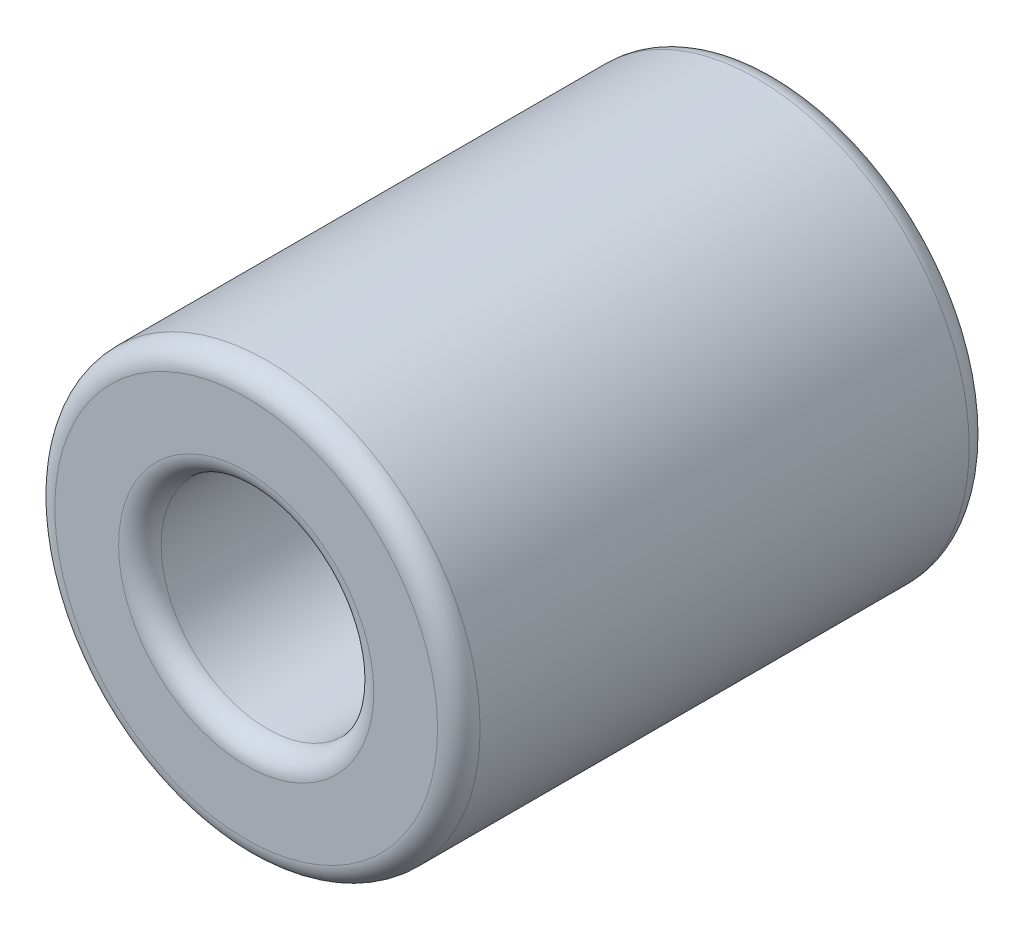
ISO-10303-21;
HEADER;
FILE_DESCRIPTION(('STEP AP214'),'2;1');
FILE_NAME('part.step','',(''),(''),'','','');
FILE_SCHEMA(('AUTOMOTIVE_DESIGN { 1 0 10303 214 1 1 1 1 }'));
ENDSEC;
DATA;
#1=APPLICATION_CONTEXT('core data for automotive mechanical design processes');
#2=APPLICATION_PROTOCOL_DEFINITION('international standard','automotive_design',2000,#1);
#3=PRODUCT_CONTEXT('',#1,'mechanical');
#4=PRODUCT('Part','Part','',(#3));
#5=PRODUCT_RELATED_PRODUCT_CATEGORY('part','',(#4));
#6=PRODUCT_DEFINITION_FORMATION('','',#4);
#7=PRODUCT_DEFINITION_CONTEXT('part definition',#1,'design');
#8=PRODUCT_DEFINITION('design','',#6,#7);
#9=PRODUCT_DEFINITION_SHAPE('','',#8);
#10=(LENGTH_UNIT() NAMED_UNIT(*) SI_UNIT(.MILLI.,.METRE.));
#11=(NAMED_UNIT(*) PLANE_ANGLE_UNIT() SI_UNIT($,.RADIAN.));
#12=(NAMED_UNIT(*) SI_UNIT($,.STERADIAN.) SOLID_ANGLE_UNIT());
#13=UNCERTAINTY_MEASURE_WITH_UNIT(LENGTH_MEASURE(1.E-05),#10,'distance_accuracy_value','');
#14=(GEOMETRIC_REPRESENTATION_CONTEXT(3) GLOBAL_UNCERTAINTY_ASSIGNED_CONTEXT((#13)) GLOBAL_UNIT_ASSIGNED_CONTEXT((#10,
#11,#12)) REPRESENTATION_CONTEXT('',''));
#15=CARTESIAN_POINT('',(0.,0.,0.));
#16=DIRECTION('',(0.,0.,1.));
#17=DIRECTION('',(1.,0.,0.));
#18=AXIS2_PLACEMENT_3D('',#15,#16,#17);
#19=CARTESIAN_POINT('',(0.,0.,25.));
#20=DIRECTION('',(0.,0.,-1.));
#21=DIRECTION('',(-1.,0.,0.));
#22=AXIS2_PLACEMENT_3D('',#19,#20,#21);
#23=CYLINDRICAL_SURFACE('',#22,5.);
#24=CARTESIAN_POINT('',(0.,0.,24.));
#25=DIRECTION('',(0.,0.,1.));
#26=DIRECTION('',(1.,0.,0.));
#27=AXIS2_PLACEMENT_3D('',#24,#25,#26);
#28=CIRCLE('',#27,5.);
#29=CARTESIAN_POINT('',(5.,0.,24.));
#30=VERTEX_POINT('',#29);
#31=EDGE_CURVE('E69',#30,#30,#28,.T.);
#32=ORIENTED_EDGE('',*,*,#31,.T.);
#33=EDGE_LOOP('',(#32));
#34=FACE_BOUND('',#33,.T.);
#35=CARTESIAN_POINT('',(0.,0.,15.));
#36=DIRECTION('',(0.,0.,-1.));
#37=DIRECTION('',(-1.,0.,0.));
#38=AXIS2_PLACEMENT_3D('',#35,#36,#37);
#39=CIRCLE('',#38,5.);
#40=CARTESIAN_POINT('',(-5.,0.,15.));
#41=VERTEX_POINT('',#40);
#42=EDGE_CURVE('E41',#41,#41,#39,.T.);
#43=ORIENTED_EDGE('',*,*,#42,.T.);
#44=EDGE_LOOP('',(#43));
#45=FACE_BOUND('',#44,.T.);
#46=ADVANCED_FACE('F37',(#34,#45),#23,.F.);
#47=CARTESIAN_POINT('',(0.,0.,25.));
#48=DIRECTION('',(0.,0.,1.));
#49=DIRECTION('',(1.,0.,0.));
#50=AXIS2_PLACEMENT_3D('',#47,#48,#49);
#51=PLANE('',#50);
#52=CARTESIAN_POINT('',(0.,0.,25.));
#53=DIRECTION('',(0.,0.,1.));
#54=DIRECTION('',(1.,0.,0.));
#55=AXIS2_PLACEMENT_3D('',#52,#53,#54);
#56=CIRCLE('',#55,6.);
#57=CARTESIAN_POINT('',(6.,0.,25.));
#58=VERTEX_POINT('',#57);
#59=EDGE_CURVE('E46',#58,#58,#56,.F.);
#60=ORIENTED_EDGE('',*,*,#59,.T.);
#61=EDGE_LOOP('',(#60));
#62=FACE_BOUND('',#61,.T.);
#63=CARTESIAN_POINT('',(0.,0.,25.));
#64=DIRECTION('',(0.,0.,1.));
#65=DIRECTION('',(1.,0.,0.));
#66=AXIS2_PLACEMENT_3D('',#63,#64,#65);
#67=CIRCLE('',#66,9.);
#68=CARTESIAN_POINT('',(9.,0.,25.));
#69=VERTEX_POINT('',#68);
#70=EDGE_CURVE('E51',#69,#69,#67,.T.);
#71=ORIENTED_EDGE('',*,*,#70,.T.);
#72=EDGE_LOOP('',(#71));
#73=FACE_BOUND('',#72,.T.);
#74=ADVANCED_FACE('F96',(#62,#73),#51,.T.);
#75=CARTESIAN_POINT('',(0.,0.,0.));
#76=DIRECTION('',(0.,0.,1.));
#77=DIRECTION('',(1.,0.,0.));
#78=AXIS2_PLACEMENT_3D('',#75,#76,#77);
#79=PLANE('',#78);
#80=CARTESIAN_POINT('',(0.,0.,0.));
#81=DIRECTION('',(0.,0.,1.));
#82=DIRECTION('',(1.,0.,0.));
#83=AXIS2_PLACEMENT_3D('',#80,#81,#82);
#84=CIRCLE('',#83,6.);
#85=CARTESIAN_POINT('',(6.,0.,0.));
#86=VERTEX_POINT('',#85);
#87=EDGE_CURVE('E73',#86,#86,#84,.T.);
#88=ORIENTED_EDGE('',*,*,#87,.T.);
#89=EDGE_LOOP('',(#88));
#90=FACE_BOUND('',#89,.T.);
#91=CARTESIAN_POINT('',(0.,0.,0.));
#92=DIRECTION('',(0.,0.,1.));
#93=DIRECTION('',(1.,0.,0.));
#94=AXIS2_PLACEMENT_3D('',#91,#92,#93);
#95=CIRCLE('',#94,9.);
#96=CARTESIAN_POINT('',(9.,0.,0.));
#97=VERTEX_POINT('',#96);
#98=EDGE_CURVE('E77',#97,#97,#95,.F.);
#99=ORIENTED_EDGE('',*,*,#98,.T.);
#100=EDGE_LOOP('',(#99));
#101=FACE_BOUND('',#100,.T.);
#102=ADVANCED_FACE('F103',(#90,#101),#79,.F.);
#103=CARTESIAN_POINT('',(0.,0.,25.));
#104=DIRECTION('',(0.,0.,-1.));
#105=DIRECTION('',(-1.,0.,0.));
#106=AXIS2_PLACEMENT_3D('',#103,#104,#105);
#107=CYLINDRICAL_SURFACE('',#106,10.);
#108=CARTESIAN_POINT('',(0.,0.,1.));
#109=DIRECTION('',(0.,0.,1.));
#110=DIRECTION('',(1.,0.,0.));
#111=AXIS2_PLACEMENT_3D('',#108,#109,#110);
#112=CIRCLE('',#111,10.);
#113=CARTESIAN_POINT('',(10.,0.,1.));
#114=VERTEX_POINT('',#113);
#115=EDGE_CURVE('E57',#114,#114,#112,.T.);
#116=ORIENTED_EDGE('',*,*,#115,.T.);
#117=EDGE_LOOP('',(#116));
#118=FACE_BOUND('',#117,.T.);
#119=CARTESIAN_POINT('',(0.,0.,24.));
#120=DIRECTION('',(0.,0.,1.));
#121=DIRECTION('',(1.,0.,0.));
#122=AXIS2_PLACEMENT_3D('',#119,#120,#121);
#123=CIRCLE('',#122,10.);
#124=CARTESIAN_POINT('',(10.,0.,24.));
#125=VERTEX_POINT('',#124);
#126=EDGE_CURVE('E61',#125,#125,#123,.F.);
#127=ORIENTED_EDGE('',*,*,#126,.T.);
#128=EDGE_LOOP('',(#127));
#129=FACE_BOUND('',#128,.T.);
#130=ADVANCED_FACE('F108',(#118,#129),#107,.T.);
#131=CARTESIAN_POINT('',(0.,0.,10.));
#132=DIRECTION('',(0.,0.,-1.));
#133=DIRECTION('',(-1.,0.,0.));
#134=AXIS2_PLACEMENT_3D('',#131,#132,#133);
#135=CIRCLE('',#134,5.);
#136=CARTESIAN_POINT('',(-5.,0.,10.));
#137=VERTEX_POINT('',#136);
#138=EDGE_CURVE('E10',#137,#137,#135,.T.);
#139=ORIENTED_EDGE('',*,*,#138,.F.);
#140=EDGE_LOOP('',(#139));
#141=FACE_BOUND('',#140,.T.);
#142=CARTESIAN_POINT('',(0.,0.,1.));
#143=DIRECTION('',(0.,0.,1.));
#144=DIRECTION('',(1.,0.,0.));
#145=AXIS2_PLACEMENT_3D('',#142,#143,#144);
#146=CIRCLE('',#145,5.);
#147=CARTESIAN_POINT('',(5.,0.,1.));
#148=VERTEX_POINT('',#147);
#149=EDGE_CURVE('E65',#148,#148,#146,.F.);
#150=ORIENTED_EDGE('',*,*,#149,.T.);
#151=EDGE_LOOP('',(#150));
#152=FACE_BOUND('',#151,.T.);
#153=ADVANCED_FACE('F99',(#141,#152),#23,.F.);
#154=CARTESIAN_POINT('',(0.,0.,1.));
#155=DIRECTION('',(0.,0.,1.));
#156=DIRECTION('',(1.,0.,0.));
#157=AXIS2_PLACEMENT_3D('',#154,#155,#156);
#158=TOROIDAL_SURFACE('',#157,6.,1.);
#159=ORIENTED_EDGE('',*,*,#149,.F.);
#160=EDGE_LOOP('',(#159));
#161=FACE_BOUND('',#160,.T.);
#162=ORIENTED_EDGE('',*,*,#87,.F.);
#163=EDGE_LOOP('',(#162));
#164=FACE_BOUND('',#163,.T.);
#165=ADVANCED_FACE('F107',(#161,#164),#158,.T.);
#166=CARTESIAN_POINT('',(0.,0.,1.));
#167=DIRECTION('',(0.,0.,1.));
#168=DIRECTION('',(1.,0.,0.));
#169=AXIS2_PLACEMENT_3D('',#166,#167,#168);
#170=TOROIDAL_SURFACE('',#169,9.,1.);
#171=ORIENTED_EDGE('',*,*,#98,.F.);
#172=EDGE_LOOP('',(#171));
#173=FACE_BOUND('',#172,.T.);
#174=ORIENTED_EDGE('',*,*,#115,.F.);
#175=EDGE_LOOP('',(#174));
#176=FACE_BOUND('',#175,.T.);
#177=ADVANCED_FACE('F114',(#173,#176),#170,.T.);
#178=CARTESIAN_POINT('',(0.,0.,24.));
#179=DIRECTION('',(0.,0.,1.));
#180=DIRECTION('',(1.,0.,0.));
#181=AXIS2_PLACEMENT_3D('',#178,#179,#180);
#182=TOROIDAL_SURFACE('',#181,6.,1.);
#183=ORIENTED_EDGE('',*,*,#59,.F.);
#184=EDGE_LOOP('',(#183));
#185=FACE_BOUND('',#184,.T.);
#186=ORIENTED_EDGE('',*,*,#31,.F.);
#187=EDGE_LOOP('',(#186));
#188=FACE_BOUND('',#187,.T.);
#189=ADVANCED_FACE('F130',(#185,#188),#182,.T.);
#190=CARTESIAN_POINT('',(0.,0.,24.));
#191=DIRECTION('',(0.,0.,1.));
#192=DIRECTION('',(1.,0.,0.));
#193=AXIS2_PLACEMENT_3D('',#190,#191,#192);
#194=TOROIDAL_SURFACE('',#193,9.,1.);
#195=ORIENTED_EDGE('',*,*,#126,.F.);
#196=EDGE_LOOP('',(#195));
#197=FACE_BOUND('',#196,.T.);
#198=ORIENTED_EDGE('',*,*,#70,.F.);
#199=EDGE_LOOP('',(#198));
#200=FACE_BOUND('',#199,.T.);
#201=ADVANCED_FACE('F39',(#197,#200),#194,.T.);
#202=CARTESIAN_POINT('',(0.,0.,10.));
#203=DIRECTION('',(0.,0.,-1.));
#204=DIRECTION('',(-1.,0.,0.));
#205=AXIS2_PLACEMENT_3D('',#202,#203,#204);
#206=PLANE('',#205);
#207=ORIENTED_EDGE('',*,*,#138,.T.);
#208=EDGE_LOOP('',(#207));
#209=FACE_BOUND('',#208,.T.);
#210=ADVANCED_FACE('F89',(#209),#206,.T.);
#211=CARTESIAN_POINT('',(0.,0.,15.));
#212=DIRECTION('',(0.,0.,-1.));
#213=DIRECTION('',(-1.,0.,0.));
#214=AXIS2_PLACEMENT_3D('',#211,#212,#213);
#215=PLANE('',#214);
#216=ORIENTED_EDGE('',*,*,#42,.F.);
#217=EDGE_LOOP('',(#216));
#218=FACE_BOUND('',#217,.T.);
#219=ADVANCED_FACE('F87',(#218),#215,.F.);
#220=CLOSED_SHELL('',(#46,#74,#102,#130,#153,#165,#177,#189,#201,#210,#219));
#221=MANIFOLD_SOLID_BREP('B2',#220);
#222=ADVANCED_BREP_SHAPE_REPRESENTATION('',(#18,#221),#14);
#223=SHAPE_DEFINITION_REPRESENTATION(#9,#222);
ENDSEC;
END-ISO-10303-21;
